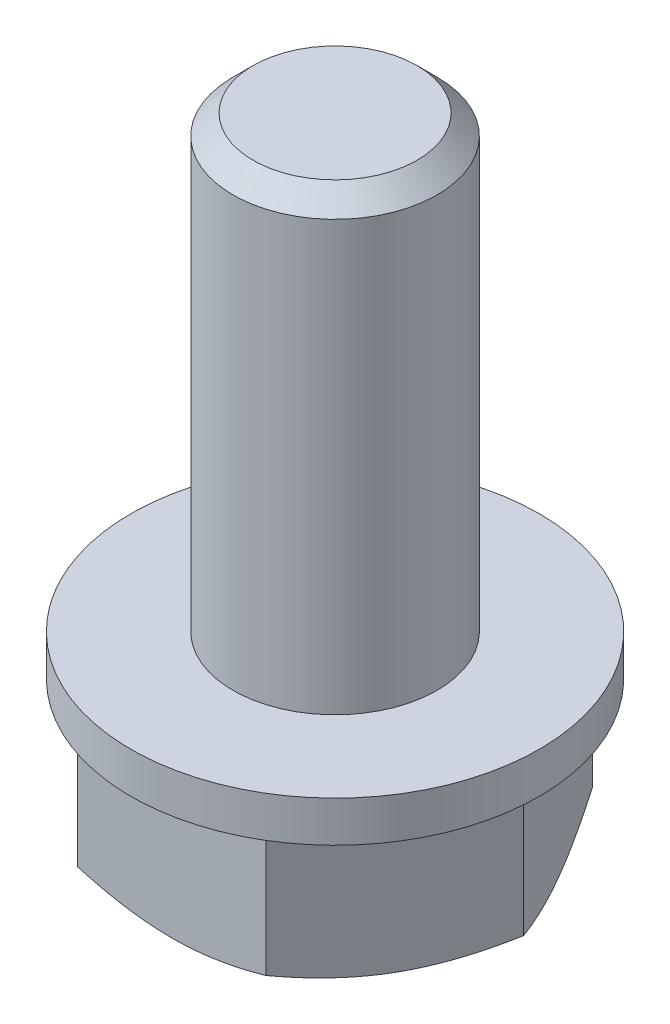
ISO-10303-21;
HEADER;
FILE_DESCRIPTION(('STEP AP214'),'2;1');
FILE_NAME('part.step','',(''),(''),'','','');
FILE_SCHEMA(('AUTOMOTIVE_DESIGN { 1 0 10303 214 1 1 1 1 }'));
ENDSEC;
DATA;
#1=APPLICATION_CONTEXT('core data for automotive mechanical design processes');
#2=APPLICATION_PROTOCOL_DEFINITION('international standard','automotive_design',2000,#1);
#3=PRODUCT_CONTEXT('',#1,'mechanical');
#4=PRODUCT('Part','Part','',(#3));
#5=PRODUCT_RELATED_PRODUCT_CATEGORY('part','',(#4));
#6=PRODUCT_DEFINITION_FORMATION('','',#4);
#7=PRODUCT_DEFINITION_CONTEXT('part definition',#1,'design');
#8=PRODUCT_DEFINITION('design','',#6,#7);
#9=PRODUCT_DEFINITION_SHAPE('','',#8);
#10=(LENGTH_UNIT() NAMED_UNIT(*) SI_UNIT(.MILLI.,.METRE.));
#11=(NAMED_UNIT(*) PLANE_ANGLE_UNIT() SI_UNIT($,.RADIAN.));
#12=(NAMED_UNIT(*) SI_UNIT($,.STERADIAN.) SOLID_ANGLE_UNIT());
#13=UNCERTAINTY_MEASURE_WITH_UNIT(LENGTH_MEASURE(1.E-05),#10,'distance_accuracy_value','');
#14=(GEOMETRIC_REPRESENTATION_CONTEXT(3) GLOBAL_UNCERTAINTY_ASSIGNED_CONTEXT((#13)) GLOBAL_UNIT_ASSIGNED_CONTEXT((#10,
#11,#12)) REPRESENTATION_CONTEXT('',''));
#15=CARTESIAN_POINT('',(0.,0.,0.));
#16=DIRECTION('',(0.,0.,1.));
#17=DIRECTION('',(1.,0.,0.));
#18=AXIS2_PLACEMENT_3D('',#15,#16,#17);
#19=CARTESIAN_POINT('',(-12.374368670765,-45.18,10.374368670765));
#20=DIRECTION('',(0.,-1.,0.));
#21=DIRECTION('',(0.,0.,-1.));
#22=AXIS2_PLACEMENT_3D('',#19,#20,#21);
#23=PLANE('',#22);
#24=CARTESIAN_POINT('',(-12.374368670765,-45.18,12.374368670765));
#25=DIRECTION('',(0.,-1.,0.));
#26=DIRECTION('',(0.,0.,-1.));
#27=AXIS2_PLACEMENT_3D('',#24,#25,#26);
#28=CIRCLE('',#27,4.);
#29=CARTESIAN_POINT('',(-12.374368670765,-45.18,8.374368670765));
#30=VERTEX_POINT('',#29);
#31=CARTESIAN_POINT('',(-8.91026705562725,-45.18,10.374368670765));
#32=VERTEX_POINT('',#31);
#33=EDGE_CURVE('E132',#30,#32,#28,.T.);
#34=ORIENTED_EDGE('',*,*,#33,.T.);
#35=CARTESIAN_POINT('',(-12.374368670765,-45.18,12.374368670765));
#36=DIRECTION('',(0.,-1.,0.));
#37=DIRECTION('',(0.,0.,-1.));
#38=AXIS2_PLACEMENT_3D('',#35,#36,#37);
#39=CIRCLE('',#38,4.);
#40=CARTESIAN_POINT('',(-8.91026705562725,-45.18,14.374368670765));
#41=VERTEX_POINT('',#40);
#42=EDGE_CURVE('E114',#32,#41,#39,.T.);
#43=ORIENTED_EDGE('',*,*,#42,.T.);
#44=CARTESIAN_POINT('',(-12.374368670765,-45.18,12.374368670765));
#45=DIRECTION('',(0.,-1.,0.));
#46=DIRECTION('',(0.,0.,-1.));
#47=AXIS2_PLACEMENT_3D('',#44,#45,#46);
#48=CIRCLE('',#47,4.);
#49=CARTESIAN_POINT('',(-12.374368670765,-45.18,16.374368670765));
#50=VERTEX_POINT('',#49);
#51=EDGE_CURVE('E131',#41,#50,#48,.T.);
#52=ORIENTED_EDGE('',*,*,#51,.T.);
#53=CARTESIAN_POINT('',(-12.374368670765,-45.18,12.374368670765));
#54=DIRECTION('',(0.,-1.,0.));
#55=DIRECTION('',(0.,0.,-1.));
#56=AXIS2_PLACEMENT_3D('',#53,#54,#55);
#57=CIRCLE('',#56,4.);
#58=CARTESIAN_POINT('',(-15.8384702859027,-45.18,14.374368670765));
#59=VERTEX_POINT('',#58);
#60=EDGE_CURVE('E229',#50,#59,#57,.T.);
#61=ORIENTED_EDGE('',*,*,#60,.T.);
#62=CARTESIAN_POINT('',(-12.374368670765,-45.18,12.374368670765));
#63=DIRECTION('',(0.,-1.,0.));
#64=DIRECTION('',(0.,0.,-1.));
#65=AXIS2_PLACEMENT_3D('',#62,#63,#64);
#66=CIRCLE('',#65,4.);
#67=CARTESIAN_POINT('',(-15.8384702859027,-45.18,10.374368670765));
#68=VERTEX_POINT('',#67);
#69=EDGE_CURVE('E151',#59,#68,#66,.T.);
#70=ORIENTED_EDGE('',*,*,#69,.T.);
#71=CARTESIAN_POINT('',(-12.374368670765,-45.18,12.374368670765));
#72=DIRECTION('',(0.,-1.,0.));
#73=DIRECTION('',(0.,0.,-1.));
#74=AXIS2_PLACEMENT_3D('',#71,#72,#73);
#75=CIRCLE('',#74,4.);
#76=EDGE_CURVE('E145',#68,#30,#75,.T.);
#77=ORIENTED_EDGE('',*,*,#76,.T.);
#78=EDGE_LOOP('',(#34,#43,#52,#61,#70,#77));
#79=FACE_BOUND('',#78,.T.);
#80=ADVANCED_FACE('F16',(#79),#23,.T.);
#81=CARTESIAN_POINT('',(-12.374368670765,-42.6413248654052,12.374368670765));
#82=DIRECTION('',(0.,1.,0.));
#83=DIRECTION('',(0.,0.,-1.));
#84=AXIS2_PLACEMENT_3D('',#81,#82,#83);
#85=CYLINDRICAL_SURFACE('',#84,5.);
#86=CARTESIAN_POINT('',(-12.374368670765,-40.68,12.374368670765));
#87=DIRECTION('',(0.,-1.,0.));
#88=DIRECTION('',(0.,0.,-1.));
#89=AXIS2_PLACEMENT_3D('',#86,#87,#88);
#90=CIRCLE('',#89,5.);
#91=CARTESIAN_POINT('',(-12.374368670765,-40.68,7.374368670765));
#92=VERTEX_POINT('',#91);
#93=EDGE_CURVE('E11',#92,#92,#90,.T.);
#94=ORIENTED_EDGE('',*,*,#93,.T.);
#95=EDGE_LOOP('',(#94));
#96=FACE_BOUND('',#95,.T.);
#97=CARTESIAN_POINT('',(-12.374368670765,-41.68,12.374368670765));
#98=DIRECTION('',(0.,1.,0.));
#99=DIRECTION('',(0.,0.,-1.));
#100=AXIS2_PLACEMENT_3D('',#97,#98,#99);
#101=CIRCLE('',#100,5.);
#102=CARTESIAN_POINT('',(-12.374368670765,-41.68,7.374368670765));
#103=VERTEX_POINT('',#102);
#104=EDGE_CURVE('E20',#103,#103,#101,.T.);
#105=ORIENTED_EDGE('',*,*,#104,.T.);
#106=EDGE_LOOP('',(#105));
#107=FACE_BOUND('',#106,.T.);
#108=ADVANCED_FACE('F293',(#96,#107),#85,.T.);
#109=CARTESIAN_POINT('',(-12.374368670765,-40.68,8.624368670765));
#110=DIRECTION('',(0.,1.,0.));
#111=DIRECTION('',(0.,0.,1.));
#112=AXIS2_PLACEMENT_3D('',#109,#110,#111);
#113=PLANE('',#112);
#114=CARTESIAN_POINT('',(-12.374368670765,-40.68,12.374368670765));
#115=DIRECTION('',(0.,-1.,0.));
#116=DIRECTION('',(0.,0.,-1.));
#117=AXIS2_PLACEMENT_3D('',#114,#115,#116);
#118=CIRCLE('',#117,2.5);
#119=CARTESIAN_POINT('',(-12.374368670765,-40.68,9.874368670765));
#120=VERTEX_POINT('',#119);
#121=EDGE_CURVE('E26',#120,#120,#118,.T.);
#122=ORIENTED_EDGE('',*,*,#121,.T.);
#123=EDGE_LOOP('',(#122));
#124=FACE_BOUND('',#123,.T.);
#125=ORIENTED_EDGE('',*,*,#93,.F.);
#126=EDGE_LOOP('',(#125));
#127=FACE_BOUND('',#126,.T.);
#128=ADVANCED_FACE('F298',(#124,#127),#113,.T.);
#129=CARTESIAN_POINT('',(-12.374368670765,-35.42525,12.374368670765));
#130=DIRECTION('',(0.,1.,0.));
#131=DIRECTION('',(0.,0.,-1.));
#132=AXIS2_PLACEMENT_3D('',#129,#130,#131);
#133=CYLINDRICAL_SURFACE('',#132,2.5);
#134=CARTESIAN_POINT('',(-12.374368670765,-30.1705,12.374368670765));
#135=DIRECTION('',(0.,-1.,0.));
#136=DIRECTION('',(0.,0.,-1.));
#137=AXIS2_PLACEMENT_3D('',#134,#135,#136);
#138=CIRCLE('',#137,2.5);
#139=CARTESIAN_POINT('',(-12.374368670765,-30.1705,9.874368670765));
#140=VERTEX_POINT('',#139);
#141=EDGE_CURVE('E205',#140,#140,#138,.T.);
#142=ORIENTED_EDGE('',*,*,#141,.T.);
#143=EDGE_LOOP('',(#142));
#144=FACE_BOUND('',#143,.T.);
#145=ORIENTED_EDGE('',*,*,#121,.F.);
#146=EDGE_LOOP('',(#145));
#147=FACE_BOUND('',#146,.T.);
#148=ADVANCED_FACE('F302',(#144,#147),#133,.T.);
#149=CARTESIAN_POINT('',(-12.374368670765,-29.92525,12.374368670765));
#150=DIRECTION('',(0.,-1.,0.));
#151=DIRECTION('',(0.,0.,-1.));
#152=AXIS2_PLACEMENT_3D('',#149,#150,#151);
#153=CONICAL_SURFACE('',#152,2.25475,0.785398163397448);
#154=CARTESIAN_POINT('',(-12.374368670765,-29.68,12.374368670765));
#155=DIRECTION('',(0.,-1.,0.));
#156=DIRECTION('',(0.,0.,-1.));
#157=AXIS2_PLACEMENT_3D('',#154,#155,#156);
#158=CIRCLE('',#157,2.0095);
#159=CARTESIAN_POINT('',(-12.374368670765,-29.68,10.364868670765));
#160=VERTEX_POINT('',#159);
#161=EDGE_CURVE('E210',#160,#160,#158,.T.);
#162=ORIENTED_EDGE('',*,*,#161,.T.);
#163=EDGE_LOOP('',(#162));
#164=FACE_BOUND('',#163,.T.);
#165=ORIENTED_EDGE('',*,*,#141,.F.);
#166=EDGE_LOOP('',(#165));
#167=FACE_BOUND('',#166,.T.);
#168=ADVANCED_FACE('F306',(#164,#167),#153,.T.);
#169=CARTESIAN_POINT('',(-12.374368670765,-29.68,11.369618670765));
#170=DIRECTION('',(0.,1.,0.));
#171=DIRECTION('',(0.,0.,1.));
#172=AXIS2_PLACEMENT_3D('',#169,#170,#171);
#173=PLANE('',#172);
#174=ORIENTED_EDGE('',*,*,#161,.F.);
#175=EDGE_LOOP('',(#174));
#176=FACE_BOUND('',#175,.T.);
#177=ADVANCED_FACE('F308',(#176),#173,.T.);
#178=CARTESIAN_POINT('',(-12.374368670765,-44.8913248654052,12.374368670765));
#179=DIRECTION('',(0.,1.,0.));
#180=DIRECTION('',(0.,0.,-1.));
#181=AXIS2_PLACEMENT_3D('',#178,#179,#180);
#182=CONICAL_SURFACE('',#181,4.5,1.04719755119662);
#183=CARTESIAN_POINT('',(-12.374368670765,-45.18,16.374368670765));
#184=CARTESIAN_POINT('',(-13.446165440497,-45.18,16.374368670765));
#185=CARTESIAN_POINT('',(-14.6837697475235,-44.8227344100918,16.374368670765));
#186=(BOUNDED_CURVE() B_SPLINE_CURVE(2,(#183,#184,#185),.UNSPECIFIED.,.F.,
.F.) B_SPLINE_CURVE_WITH_KNOTS((3,3),(3.06610202231448,5.50179922142013),
.UNSPECIFIED.) CURVE() GEOMETRIC_REPRESENTATION_ITEM() RATIONAL_B_SPLINE_CURVE((1.,
1.04818815858901,1.01981541864881)) REPRESENTATION_ITEM(''));
#187=CARTESIAN_POINT('',(-14.6837697475235,-44.8227344100919,16.374368670765));
#188=VERTEX_POINT('',#187);
#189=EDGE_CURVE('E166',#50,#188,#186,.T.);
#190=ORIENTED_EDGE('',*,*,#189,.T.);
#191=CARTESIAN_POINT('',(-14.6837697475235,-44.8227344100918,16.374368670765));
#192=CARTESIAN_POINT('',(-15.3025719010405,-45.1799999999999,15.3025719010405));
#193=CARTESIAN_POINT('',(-15.8384702859027,-45.18,14.374368670765));
#194=(BOUNDED_CURVE() B_SPLINE_CURVE(2,(#191,#192,#193),.UNSPECIFIED.,.F.,
.F.) B_SPLINE_CURVE_WITH_KNOTS((3,3),(0.630404823226759,3.06610202231449),
.UNSPECIFIED.) CURVE() GEOMETRIC_REPRESENTATION_ITEM() RATIONAL_B_SPLINE_CURVE((1.01981541864924,
1.04818815858868,1.)) REPRESENTATION_ITEM(''));
#195=EDGE_CURVE('E138',#188,#59,#194,.T.);
#196=ORIENTED_EDGE('',*,*,#195,.T.);
#197=ORIENTED_EDGE('',*,*,#60,.F.);
#198=EDGE_LOOP('',(#190,#196,#197));
#199=FACE_BOUND('',#198,.T.);
#200=ADVANCED_FACE('F279',(#199),#182,.T.);
#201=CARTESIAN_POINT('',(-12.374368670765,-44.8913248654052,12.374368670765));
#202=DIRECTION('',(0.,1.,0.));
#203=DIRECTION('',(0.,0.,-1.));
#204=AXIS2_PLACEMENT_3D('',#201,#202,#203);
#205=CONICAL_SURFACE('',#204,4.5,1.04719755119662);
#206=CARTESIAN_POINT('',(-8.91026705562725,-45.18,14.374368670765));
#207=CARTESIAN_POINT('',(-9.44616544049328,-45.18,15.3025719010471));
#208=CARTESIAN_POINT('',(-10.0649675940065,-44.8227344100919,16.374368670765));
#209=(BOUNDED_CURVE() B_SPLINE_CURVE(2,(#206,#207,#208),.UNSPECIFIED.,.F.,
.F.) B_SPLINE_CURVE_WITH_KNOTS((3,3),(3.06610202231449,5.50179922142015),
.UNSPECIFIED.) CURVE() GEOMETRIC_REPRESENTATION_ITEM() RATIONAL_B_SPLINE_CURVE((1.,
1.04818815858904,1.01981541864882)) REPRESENTATION_ITEM(''));
#210=CARTESIAN_POINT('',(-10.0649675940065,-44.8227344100919,16.374368670765));
#211=VERTEX_POINT('',#210);
#212=EDGE_CURVE('E106',#41,#211,#209,.T.);
#213=ORIENTED_EDGE('',*,*,#212,.T.);
#214=CARTESIAN_POINT('',(-10.0649675940065,-44.8227344100919,16.374368670765));
#215=CARTESIAN_POINT('',(-11.3025719010405,-45.1800000000001,16.374368670765));
#216=CARTESIAN_POINT('',(-12.374368670765,-45.18,16.374368670765));
#217=(BOUNDED_CURVE() B_SPLINE_CURVE(2,(#214,#215,#216),.UNSPECIFIED.,.F.,
.F.) B_SPLINE_CURVE_WITH_KNOTS((3,3),(0.630404823226771,3.06610202231448),
.UNSPECIFIED.) CURVE() GEOMETRIC_REPRESENTATION_ITEM() RATIONAL_B_SPLINE_CURVE((1.01981541864923,
1.04818815858865,1.)) REPRESENTATION_ITEM(''));
#218=EDGE_CURVE('E154',#211,#50,#217,.T.);
#219=ORIENTED_EDGE('',*,*,#218,.T.);
#220=ORIENTED_EDGE('',*,*,#51,.F.);
#221=EDGE_LOOP('',(#213,#219,#220));
#222=FACE_BOUND('',#221,.T.);
#223=ADVANCED_FACE('F270',(#222),#205,.T.);
#224=CARTESIAN_POINT('',(-12.374368670765,-44.8913248654052,12.374368670765));
#225=DIRECTION('',(0.,1.,0.));
#226=DIRECTION('',(0.,0.,-1.));
#227=AXIS2_PLACEMENT_3D('',#224,#225,#226);
#228=CONICAL_SURFACE('',#227,4.5,1.04719755119662);
#229=CARTESIAN_POINT('',(-8.91026705562725,-45.18,10.374368670765));
#230=CARTESIAN_POINT('',(-8.37436867076123,-45.18,11.302571901047));
#231=CARTESIAN_POINT('',(-7.75556651724801,-44.8227344100919,12.374368670765));
#232=(BOUNDED_CURVE() B_SPLINE_CURVE(2,(#229,#230,#231),.UNSPECIFIED.,.F.,
.F.) B_SPLINE_CURVE_WITH_KNOTS((3,3),(3.06610202231449,5.50179922142014),
.UNSPECIFIED.) CURVE() GEOMETRIC_REPRESENTATION_ITEM() RATIONAL_B_SPLINE_CURVE((1.,
1.04818815858902,1.01981541864881)) REPRESENTATION_ITEM(''));
#233=CARTESIAN_POINT('',(-7.755566517248,-44.8227344100919,12.374368670765));
#234=VERTEX_POINT('',#233);
#235=EDGE_CURVE('E109',#32,#234,#232,.T.);
#236=ORIENTED_EDGE('',*,*,#235,.T.);
#237=CARTESIAN_POINT('',(-7.755566517248,-44.8227344100919,12.374368670765));
#238=CARTESIAN_POINT('',(-8.37436867076501,-45.1800000000001,13.4461654404895));
#239=CARTESIAN_POINT('',(-8.91026705562725,-45.18,14.374368670765));
#240=(BOUNDED_CURVE() B_SPLINE_CURVE(2,(#237,#238,#239),.UNSPECIFIED.,.F.,
.F.) B_SPLINE_CURVE_WITH_KNOTS((3,3),(0.630404823226775,3.06610202231449),
.UNSPECIFIED.) CURVE() GEOMETRIC_REPRESENTATION_ITEM() RATIONAL_B_SPLINE_CURVE((1.01981541864923,
1.04818815858866,1.)) REPRESENTATION_ITEM(''));
#241=EDGE_CURVE('E97',#234,#41,#240,.T.);
#242=ORIENTED_EDGE('',*,*,#241,.T.);
#243=ORIENTED_EDGE('',*,*,#42,.F.);
#244=EDGE_LOOP('',(#236,#242,#243));
#245=FACE_BOUND('',#244,.T.);
#246=ADVANCED_FACE('F112',(#245),#228,.T.);
#247=CARTESIAN_POINT('',(-12.374368670765,-44.8913248654052,12.374368670765));
#248=DIRECTION('',(0.,1.,0.));
#249=DIRECTION('',(0.,0.,-1.));
#250=AXIS2_PLACEMENT_3D('',#247,#248,#249);
#251=CONICAL_SURFACE('',#250,4.5,1.04719755119662);
#252=CARTESIAN_POINT('',(-10.0649675940065,-44.8227344100918,8.374368670765));
#253=CARTESIAN_POINT('',(-9.44616544048951,-45.1799999999999,9.44616544048947));
#254=CARTESIAN_POINT('',(-8.91026705562725,-45.18,10.374368670765));
#255=(BOUNDED_CURVE() B_SPLINE_CURVE(2,(#252,#253,#254),.UNSPECIFIED.,.F.,
.F.) B_SPLINE_CURVE_WITH_KNOTS((3,3),(0.630404823226759,3.06610202231449),
.UNSPECIFIED.) CURVE() GEOMETRIC_REPRESENTATION_ITEM() RATIONAL_B_SPLINE_CURVE((1.01981541864924,
1.04818815858868,1.)) REPRESENTATION_ITEM(''));
#256=CARTESIAN_POINT('',(-10.0649675940065,-44.8227344100919,8.374368670765));
#257=VERTEX_POINT('',#256);
#258=EDGE_CURVE('E213',#257,#32,#255,.T.);
#259=ORIENTED_EDGE('',*,*,#258,.T.);
#260=ORIENTED_EDGE('',*,*,#33,.F.);
#261=CARTESIAN_POINT('',(-12.374368670765,-45.18,8.374368670765));
#262=CARTESIAN_POINT('',(-11.302571901033,-45.18,8.374368670765));
#263=CARTESIAN_POINT('',(-10.0649675940065,-44.8227344100918,8.37436867076499));
#264=(BOUNDED_CURVE() B_SPLINE_CURVE(2,(#261,#262,#263),.UNSPECIFIED.,.F.,
.F.) B_SPLINE_CURVE_WITH_KNOTS((3,3),(3.06610202231448,5.50179922142013),
.UNSPECIFIED.) CURVE() GEOMETRIC_REPRESENTATION_ITEM() RATIONAL_B_SPLINE_CURVE((1.,
1.04818815858901,1.01981541864881)) REPRESENTATION_ITEM(''));
#265=EDGE_CURVE('E162',#30,#257,#264,.T.);
#266=ORIENTED_EDGE('',*,*,#265,.T.);
#267=EDGE_LOOP('',(#259,#260,#266));
#268=FACE_BOUND('',#267,.T.);
#269=ADVANCED_FACE('F258',(#268),#251,.T.);
#270=CARTESIAN_POINT('',(-12.374368670765,-44.8913248654052,12.374368670765));
#271=DIRECTION('',(0.,1.,0.));
#272=DIRECTION('',(0.,0.,-1.));
#273=AXIS2_PLACEMENT_3D('',#270,#271,#272);
#274=CONICAL_SURFACE('',#273,4.5,1.04719755119662);
#275=CARTESIAN_POINT('',(-14.6837697475235,-44.8227344100919,8.37436867076501));
#276=CARTESIAN_POINT('',(-13.4461654404895,-45.1800000000001,8.37436867076501));
#277=CARTESIAN_POINT('',(-12.374368670765,-45.18,8.374368670765));
#278=(BOUNDED_CURVE() B_SPLINE_CURVE(2,(#275,#276,#277),.UNSPECIFIED.,.F.,
.F.) B_SPLINE_CURVE_WITH_KNOTS((3,3),(0.630404823226771,3.06610202231448),
.UNSPECIFIED.) CURVE() GEOMETRIC_REPRESENTATION_ITEM() RATIONAL_B_SPLINE_CURVE((1.01981541864923,
1.04818815858865,1.)) REPRESENTATION_ITEM(''));
#279=CARTESIAN_POINT('',(-14.6837697475235,-44.8227344100919,8.374368670765));
#280=VERTEX_POINT('',#279);
#281=EDGE_CURVE('E156',#280,#30,#278,.T.);
#282=ORIENTED_EDGE('',*,*,#281,.T.);
#283=ORIENTED_EDGE('',*,*,#76,.F.);
#284=CARTESIAN_POINT('',(-15.8384702859027,-45.18,10.374368670765));
#285=CARTESIAN_POINT('',(-15.3025719010368,-45.18,9.44616544048297));
#286=CARTESIAN_POINT('',(-14.6837697475235,-44.8227344100919,8.37436867076499));
#287=(BOUNDED_CURVE() B_SPLINE_CURVE(2,(#284,#285,#286),.UNSPECIFIED.,.F.,
.F.) B_SPLINE_CURVE_WITH_KNOTS((3,3),(3.06610202231449,5.50179922142015),
.UNSPECIFIED.) CURVE() GEOMETRIC_REPRESENTATION_ITEM() RATIONAL_B_SPLINE_CURVE((1.,
1.04818815858904,1.01981541864882)) REPRESENTATION_ITEM(''));
#288=EDGE_CURVE('E136',#68,#280,#287,.T.);
#289=ORIENTED_EDGE('',*,*,#288,.T.);
#290=EDGE_LOOP('',(#282,#283,#289));
#291=FACE_BOUND('',#290,.T.);
#292=ADVANCED_FACE('F18',(#291),#274,.T.);
#293=CARTESIAN_POINT('',(-12.374368670765,-44.8913248654052,12.374368670765));
#294=DIRECTION('',(0.,1.,0.));
#295=DIRECTION('',(0.,0.,-1.));
#296=AXIS2_PLACEMENT_3D('',#293,#294,#295);
#297=CONICAL_SURFACE('',#296,4.5,1.04719755119662);
#298=CARTESIAN_POINT('',(-16.993170824282,-44.8227344100919,12.374368670765));
#299=CARTESIAN_POINT('',(-16.374368670765,-45.1800000000001,11.3025719010405));
#300=CARTESIAN_POINT('',(-15.8384702859027,-45.18,10.374368670765));
#301=(BOUNDED_CURVE() B_SPLINE_CURVE(2,(#298,#299,#300),.UNSPECIFIED.,.F.,
.F.) B_SPLINE_CURVE_WITH_KNOTS((3,3),(0.630404823226775,3.06610202231449),
.UNSPECIFIED.) CURVE() GEOMETRIC_REPRESENTATION_ITEM() RATIONAL_B_SPLINE_CURVE((1.01981541864923,
1.04818815858866,1.)) REPRESENTATION_ITEM(''));
#302=CARTESIAN_POINT('',(-16.993170824282,-44.8227344100919,12.374368670765));
#303=VERTEX_POINT('',#302);
#304=EDGE_CURVE('E181',#303,#68,#301,.T.);
#305=ORIENTED_EDGE('',*,*,#304,.T.);
#306=ORIENTED_EDGE('',*,*,#69,.F.);
#307=CARTESIAN_POINT('',(-15.8384702859027,-45.18,14.374368670765));
#308=CARTESIAN_POINT('',(-16.3743686707688,-45.18,13.446165440483));
#309=CARTESIAN_POINT('',(-16.993170824282,-44.8227344100919,12.374368670765));
#310=(BOUNDED_CURVE() B_SPLINE_CURVE(2,(#307,#308,#309),.UNSPECIFIED.,.F.,
.F.) B_SPLINE_CURVE_WITH_KNOTS((3,3),(3.06610202231449,5.50179922142014),
.UNSPECIFIED.) CURVE() GEOMETRIC_REPRESENTATION_ITEM() RATIONAL_B_SPLINE_CURVE((1.,
1.04818815858902,1.01981541864881)) REPRESENTATION_ITEM(''));
#311=EDGE_CURVE('E144',#59,#303,#310,.T.);
#312=ORIENTED_EDGE('',*,*,#311,.T.);
#313=EDGE_LOOP('',(#305,#306,#312));
#314=FACE_BOUND('',#313,.T.);
#315=ADVANCED_FACE('F274',(#314),#297,.T.);
#316=CARTESIAN_POINT('',(-12.374368670765,-41.68,12.374368670765));
#317=DIRECTION('',(0.,-1.,0.));
#318=DIRECTION('',(-1.,0.,0.));
#319=AXIS2_PLACEMENT_3D('',#316,#317,#318);
#320=PLANE('',#319);
#321=DIRECTION('',(0.5,0.,-0.866025403784439));
#322=VECTOR('',#321,1.);
#323=CARTESIAN_POINT('',(-7.755566517248,-41.68,12.374368670765));
#324=LINE('',#323,#322);
#325=CARTESIAN_POINT('',(-10.0649675940065,-41.68,16.374368670765));
#326=VERTEX_POINT('',#325);
#327=CARTESIAN_POINT('',(-7.755566517248,-41.68,12.374368670765));
#328=VERTEX_POINT('',#327);
#329=EDGE_CURVE('E108',#326,#328,#324,.T.);
#330=ORIENTED_EDGE('',*,*,#329,.T.);
#331=DIRECTION('',(-0.5,0.,-0.866025403784439));
#332=VECTOR('',#331,1.);
#333=CARTESIAN_POINT('',(-10.0649675940065,-41.68,8.374368670765));
#334=LINE('',#333,#332);
#335=CARTESIAN_POINT('',(-10.0649675940065,-41.68,8.374368670765));
#336=VERTEX_POINT('',#335);
#337=EDGE_CURVE('E123',#328,#336,#334,.T.);
#338=ORIENTED_EDGE('',*,*,#337,.T.);
#339=DIRECTION('',(-1.,0.,0.));
#340=VECTOR('',#339,1.);
#341=CARTESIAN_POINT('',(-14.6837697475235,-41.68,8.374368670765));
#342=LINE('',#341,#340);
#343=CARTESIAN_POINT('',(-14.6837697475235,-41.68,8.374368670765));
#344=VERTEX_POINT('',#343);
#345=EDGE_CURVE('E133',#336,#344,#342,.T.);
#346=ORIENTED_EDGE('',*,*,#345,.T.);
#347=DIRECTION('',(-0.5,0.,0.866025403784439));
#348=VECTOR('',#347,1.);
#349=CARTESIAN_POINT('',(-16.993170824282,-41.68,12.374368670765));
#350=LINE('',#349,#348);
#351=CARTESIAN_POINT('',(-16.993170824282,-41.68,12.374368670765));
#352=VERTEX_POINT('',#351);
#353=EDGE_CURVE('E180',#344,#352,#350,.T.);
#354=ORIENTED_EDGE('',*,*,#353,.T.);
#355=DIRECTION('',(0.5,0.,0.866025403784439));
#356=VECTOR('',#355,1.);
#357=CARTESIAN_POINT('',(-14.6837697475235,-41.68,16.374368670765));
#358=LINE('',#357,#356);
#359=CARTESIAN_POINT('',(-14.6837697475235,-41.68,16.374368670765));
#360=VERTEX_POINT('',#359);
#361=EDGE_CURVE('E143',#352,#360,#358,.T.);
#362=ORIENTED_EDGE('',*,*,#361,.T.);
#363=DIRECTION('',(1.,0.,0.));
#364=VECTOR('',#363,1.);
#365=CARTESIAN_POINT('',(-10.0649675940065,-41.68,16.374368670765));
#366=LINE('',#365,#364);
#367=EDGE_CURVE('E152',#360,#326,#366,.T.);
#368=ORIENTED_EDGE('',*,*,#367,.T.);
#369=EDGE_LOOP('',(#330,#338,#346,#354,#362,#368));
#370=FACE_BOUND('',#369,.T.);
#371=ORIENTED_EDGE('',*,*,#104,.F.);
#372=EDGE_LOOP('',(#371));
#373=FACE_BOUND('',#372,.T.);
#374=ADVANCED_FACE('F262',(#370,#373),#320,.T.);
#375=CARTESIAN_POINT('',(-16.993170824282,-45.18,12.374368670765));
#376=DIRECTION('',(0.866025403784439,0.,-0.5));
#377=DIRECTION('',(-0.5,0.,-0.866025403784439));
#378=AXIS2_PLACEMENT_3D('',#375,#376,#377);
#379=PLANE('',#378);
#380=ORIENTED_EDGE('',*,*,#311,.F.);
#381=ORIENTED_EDGE('',*,*,#195,.F.);
#382=DIRECTION('',(0.,1.,0.));
#383=VECTOR('',#382,1.);
#384=CARTESIAN_POINT('',(-14.6837697475235,-45.18,16.374368670765));
#385=LINE('',#384,#383);
#386=EDGE_CURVE('E153',#188,#360,#385,.T.);
#387=ORIENTED_EDGE('',*,*,#386,.T.);
#388=ORIENTED_EDGE('',*,*,#361,.F.);
#389=DIRECTION('',(0.,1.,0.));
#390=VECTOR('',#389,1.);
#391=CARTESIAN_POINT('',(-16.993170824282,-45.18,12.374368670765));
#392=LINE('',#391,#390);
#393=EDGE_CURVE('E177',#303,#352,#392,.T.);
#394=ORIENTED_EDGE('',*,*,#393,.F.);
#395=EDGE_LOOP('',(#380,#381,#387,#388,#394));
#396=FACE_BOUND('',#395,.T.);
#397=ADVANCED_FACE('F281',(#396),#379,.F.);
#398=CARTESIAN_POINT('',(-14.6837697475235,-45.18,8.374368670765));
#399=DIRECTION('',(0.866025403784439,0.,0.5));
#400=DIRECTION('',(0.5,0.,-0.866025403784439));
#401=AXIS2_PLACEMENT_3D('',#398,#399,#400);
#402=PLANE('',#401);
#403=ORIENTED_EDGE('',*,*,#288,.F.);
#404=ORIENTED_EDGE('',*,*,#304,.F.);
#405=ORIENTED_EDGE('',*,*,#393,.T.);
#406=ORIENTED_EDGE('',*,*,#353,.F.);
#407=DIRECTION('',(0.,1.,0.));
#408=VECTOR('',#407,1.);
#409=CARTESIAN_POINT('',(-14.6837697475235,-45.18,8.374368670765));
#410=LINE('',#409,#408);
#411=EDGE_CURVE('E137',#280,#344,#410,.T.);
#412=ORIENTED_EDGE('',*,*,#411,.F.);
#413=EDGE_LOOP('',(#403,#404,#405,#406,#412));
#414=FACE_BOUND('',#413,.T.);
#415=ADVANCED_FACE('F283',(#414),#402,.F.);
#416=CARTESIAN_POINT('',(-10.0649675940065,-45.18,8.374368670765));
#417=DIRECTION('',(0.,0.,1.));
#418=DIRECTION('',(1.,0.,0.));
#419=AXIS2_PLACEMENT_3D('',#416,#417,#418);
#420=PLANE('',#419);
#421=ORIENTED_EDGE('',*,*,#265,.F.);
#422=ORIENTED_EDGE('',*,*,#281,.F.);
#423=ORIENTED_EDGE('',*,*,#411,.T.);
#424=ORIENTED_EDGE('',*,*,#345,.F.);
#425=DIRECTION('',(0.,1.,0.));
#426=VECTOR('',#425,1.);
#427=CARTESIAN_POINT('',(-10.0649675940065,-45.18,8.374368670765));
#428=LINE('',#427,#426);
#429=EDGE_CURVE('E125',#257,#336,#428,.T.);
#430=ORIENTED_EDGE('',*,*,#429,.F.);
#431=EDGE_LOOP('',(#421,#422,#423,#424,#430));
#432=FACE_BOUND('',#431,.T.);
#433=ADVANCED_FACE('F260',(#432),#420,.F.);
#434=CARTESIAN_POINT('',(-14.6837697475235,-45.18,16.374368670765));
#435=DIRECTION('',(0.,0.,-1.));
#436=DIRECTION('',(-1.,0.,0.));
#437=AXIS2_PLACEMENT_3D('',#434,#435,#436);
#438=PLANE('',#437);
#439=ORIENTED_EDGE('',*,*,#218,.F.);
#440=DIRECTION('',(0.,1.,0.));
#441=VECTOR('',#440,1.);
#442=CARTESIAN_POINT('',(-10.0649675940065,-45.18,16.374368670765));
#443=LINE('',#442,#441);
#444=EDGE_CURVE('E190',#211,#326,#443,.T.);
#445=ORIENTED_EDGE('',*,*,#444,.T.);
#446=ORIENTED_EDGE('',*,*,#367,.F.);
#447=ORIENTED_EDGE('',*,*,#386,.F.);
#448=ORIENTED_EDGE('',*,*,#189,.F.);
#449=EDGE_LOOP('',(#439,#445,#446,#447,#448));
#450=FACE_BOUND('',#449,.T.);
#451=ADVANCED_FACE('F266',(#450),#438,.F.);
#452=CARTESIAN_POINT('',(-10.0649675940065,-45.18,16.374368670765));
#453=DIRECTION('',(-0.866025403784439,0.,-0.5));
#454=DIRECTION('',(-0.5,0.,0.866025403784439));
#455=AXIS2_PLACEMENT_3D('',#452,#453,#454);
#456=PLANE('',#455);
#457=ORIENTED_EDGE('',*,*,#241,.F.);
#458=DIRECTION('',(0.,1.,0.));
#459=VECTOR('',#458,1.);
#460=CARTESIAN_POINT('',(-7.755566517248,-45.18,12.374368670765));
#461=LINE('',#460,#459);
#462=EDGE_CURVE('E102',#234,#328,#461,.T.);
#463=ORIENTED_EDGE('',*,*,#462,.T.);
#464=ORIENTED_EDGE('',*,*,#329,.F.);
#465=ORIENTED_EDGE('',*,*,#444,.F.);
#466=ORIENTED_EDGE('',*,*,#212,.F.);
#467=EDGE_LOOP('',(#457,#463,#464,#465,#466));
#468=FACE_BOUND('',#467,.T.);
#469=ADVANCED_FACE('F99',(#468),#456,.F.);
#470=CARTESIAN_POINT('',(-7.755566517248,-45.18,12.374368670765));
#471=DIRECTION('',(-0.866025403784439,0.,0.5));
#472=DIRECTION('',(0.5,0.,0.866025403784439));
#473=AXIS2_PLACEMENT_3D('',#470,#471,#472);
#474=PLANE('',#473);
#475=ORIENTED_EDGE('',*,*,#258,.F.);
#476=ORIENTED_EDGE('',*,*,#429,.T.);
#477=ORIENTED_EDGE('',*,*,#337,.F.);
#478=ORIENTED_EDGE('',*,*,#462,.F.);
#479=ORIENTED_EDGE('',*,*,#235,.F.);
#480=EDGE_LOOP('',(#475,#476,#477,#478,#479));
#481=FACE_BOUND('',#480,.T.);
#482=ADVANCED_FACE('F120',(#481),#474,.F.);
#483=CLOSED_SHELL('',(#80,#108,#128,#148,#168,#177,#200,#223,#246,#269,#292,#315,#374,#397,#415,
#433,#451,#469,#482));
#484=MANIFOLD_SOLID_BREP('B1',#483);
#485=ADVANCED_BREP_SHAPE_REPRESENTATION('',(#18,#484),#14);
#486=SHAPE_DEFINITION_REPRESENTATION(#9,#485);
ENDSEC;
END-ISO-10303-21;
